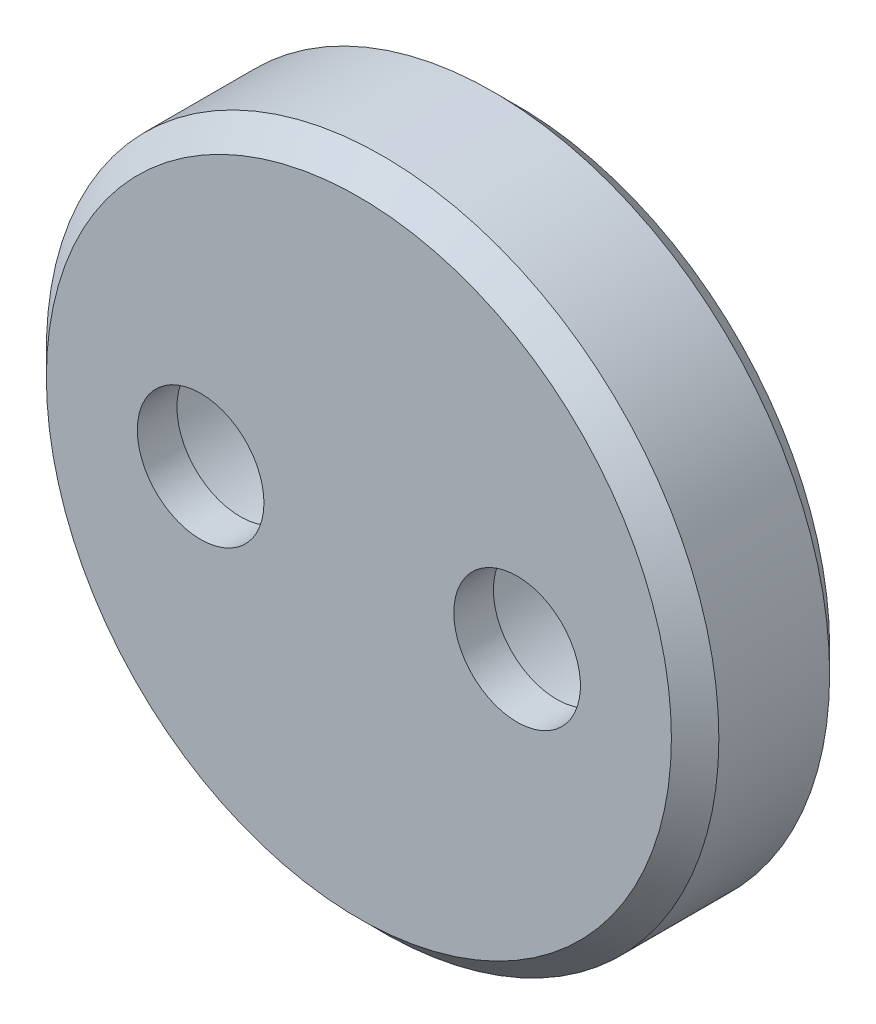
ISO-10303-21;
HEADER;
FILE_DESCRIPTION(('STEP AP214'),'2;1');
FILE_NAME('part.step','',(''),(''),'','','');
FILE_SCHEMA(('AUTOMOTIVE_DESIGN { 1 0 10303 214 1 1 1 1 }'));
ENDSEC;
DATA;
#1=APPLICATION_CONTEXT('core data for automotive mechanical design processes');
#2=APPLICATION_PROTOCOL_DEFINITION('international standard','automotive_design',2000,#1);
#3=PRODUCT_CONTEXT('',#1,'mechanical');
#4=PRODUCT('Part','Part','',(#3));
#5=PRODUCT_RELATED_PRODUCT_CATEGORY('part','',(#4));
#6=PRODUCT_DEFINITION_FORMATION('','',#4);
#7=PRODUCT_DEFINITION_CONTEXT('part definition',#1,'design');
#8=PRODUCT_DEFINITION('design','',#6,#7);
#9=PRODUCT_DEFINITION_SHAPE('','',#8);
#10=(LENGTH_UNIT() NAMED_UNIT(*) SI_UNIT(.MILLI.,.METRE.));
#11=(NAMED_UNIT(*) PLANE_ANGLE_UNIT() SI_UNIT($,.RADIAN.));
#12=(NAMED_UNIT(*) SI_UNIT($,.STERADIAN.) SOLID_ANGLE_UNIT());
#13=UNCERTAINTY_MEASURE_WITH_UNIT(LENGTH_MEASURE(1.E-05),#10,'distance_accuracy_value','');
#14=(GEOMETRIC_REPRESENTATION_CONTEXT(3) GLOBAL_UNCERTAINTY_ASSIGNED_CONTEXT((#13)) GLOBAL_UNIT_ASSIGNED_CONTEXT((#10,
#11,#12)) REPRESENTATION_CONTEXT('',''));
#15=CARTESIAN_POINT('',(0.,0.,0.));
#16=DIRECTION('',(0.,0.,1.));
#17=DIRECTION('',(1.,0.,0.));
#18=AXIS2_PLACEMENT_3D('',#15,#16,#17);
#19=CARTESIAN_POINT('',(4.,0.,4.));
#20=DIRECTION('',(0.,0.,-1.));
#21=DIRECTION('',(-1.,0.,0.));
#22=AXIS2_PLACEMENT_3D('',#19,#20,#21);
#23=CYLINDRICAL_SURFACE('',#22,1.6);
#24=CARTESIAN_POINT('',(4.,0.,4.));
#25=DIRECTION('',(0.,0.,1.));
#26=DIRECTION('',(-1.,0.,0.));
#27=AXIS2_PLACEMENT_3D('',#24,#25,#26);
#28=CIRCLE('',#27,1.6);
#29=CARTESIAN_POINT('',(2.4,0.,4.));
#30=VERTEX_POINT('',#29);
#31=EDGE_CURVE('E60',#30,#30,#28,.T.);
#32=ORIENTED_EDGE('',*,*,#31,.T.);
#33=EDGE_LOOP('',(#32));
#34=FACE_BOUND('',#33,.T.);
#35=CARTESIAN_POINT('',(4.,0.,3.));
#36=DIRECTION('',(0.,0.,-1.));
#37=DIRECTION('',(-1.,0.,0.));
#38=AXIS2_PLACEMENT_3D('',#35,#36,#37);
#39=CIRCLE('',#38,1.6);
#40=CARTESIAN_POINT('',(2.4,0.,3.));
#41=VERTEX_POINT('',#40);
#42=EDGE_CURVE('E52',#41,#41,#39,.T.);
#43=ORIENTED_EDGE('',*,*,#42,.T.);
#44=EDGE_LOOP('',(#43));
#45=FACE_BOUND('',#44,.T.);
#46=ADVANCED_FACE('F31',(#34,#45),#23,.F.);
#47=CARTESIAN_POINT('',(-4.,0.,4.));
#48=DIRECTION('',(0.,0.,-1.));
#49=DIRECTION('',(-1.,0.,0.));
#50=AXIS2_PLACEMENT_3D('',#47,#48,#49);
#51=CYLINDRICAL_SURFACE('',#50,1.6);
#52=CARTESIAN_POINT('',(-4.,0.,4.));
#53=DIRECTION('',(0.,0.,1.));
#54=DIRECTION('',(1.,0.,0.));
#55=AXIS2_PLACEMENT_3D('',#52,#53,#54);
#56=CIRCLE('',#55,1.6);
#57=CARTESIAN_POINT('',(-2.4,0.,4.));
#58=VERTEX_POINT('',#57);
#59=EDGE_CURVE('E51',#58,#58,#56,.T.);
#60=ORIENTED_EDGE('',*,*,#59,.T.);
#61=EDGE_LOOP('',(#60));
#62=FACE_BOUND('',#61,.T.);
#63=CARTESIAN_POINT('',(-4.,0.,3.));
#64=DIRECTION('',(0.,0.,-1.));
#65=DIRECTION('',(-1.,0.,0.));
#66=AXIS2_PLACEMENT_3D('',#63,#64,#65);
#67=CIRCLE('',#66,1.6);
#68=CARTESIAN_POINT('',(-5.6,0.,3.));
#69=VERTEX_POINT('',#68);
#70=EDGE_CURVE('E57',#69,#69,#67,.T.);
#71=ORIENTED_EDGE('',*,*,#70,.T.);
#72=EDGE_LOOP('',(#71));
#73=FACE_BOUND('',#72,.T.);
#74=ADVANCED_FACE('F108',(#62,#73),#51,.F.);
#75=CARTESIAN_POINT('',(0.,0.,4.));
#76=DIRECTION('',(0.,0.,1.));
#77=DIRECTION('',(1.,0.,0.));
#78=AXIS2_PLACEMENT_3D('',#75,#76,#77);
#79=PLANE('',#78);
#80=CARTESIAN_POINT('',(0.,0.,4.));
#81=DIRECTION('',(0.,0.,1.));
#82=DIRECTION('',(1.,0.,0.));
#83=AXIS2_PLACEMENT_3D('',#80,#81,#82);
#84=CIRCLE('',#83,7.9);
#85=CARTESIAN_POINT('',(7.9,0.,4.));
#86=VERTEX_POINT('',#85);
#87=EDGE_CURVE('E46',#86,#86,#84,.T.);
#88=ORIENTED_EDGE('',*,*,#87,.T.);
#89=EDGE_LOOP('',(#88));
#90=FACE_BOUND('',#89,.T.);
#91=ORIENTED_EDGE('',*,*,#59,.F.);
#92=EDGE_LOOP('',(#91));
#93=FACE_BOUND('',#92,.T.);
#94=ORIENTED_EDGE('',*,*,#31,.F.);
#95=EDGE_LOOP('',(#94));
#96=FACE_BOUND('',#95,.T.);
#97=ADVANCED_FACE('F89',(#90,#93,#96),#79,.T.);
#98=CARTESIAN_POINT('',(0.,0.,0.));
#99=DIRECTION('',(0.,0.,1.));
#100=DIRECTION('',(1.,0.,0.));
#101=AXIS2_PLACEMENT_3D('',#98,#99,#100);
#102=PLANE('',#101);
#103=CARTESIAN_POINT('',(0.,0.,0.));
#104=DIRECTION('',(0.,0.,1.));
#105=DIRECTION('',(1.,0.,0.));
#106=AXIS2_PLACEMENT_3D('',#103,#104,#105);
#107=CIRCLE('',#106,7.9);
#108=CARTESIAN_POINT('',(7.9,0.,0.));
#109=VERTEX_POINT('',#108);
#110=EDGE_CURVE('E10',#109,#109,#107,.F.);
#111=ORIENTED_EDGE('',*,*,#110,.T.);
#112=EDGE_LOOP('',(#111));
#113=FACE_BOUND('',#112,.T.);
#114=CARTESIAN_POINT('',(4.,0.,0.));
#115=DIRECTION('',(0.,0.,-1.));
#116=DIRECTION('',(-1.,0.,0.));
#117=AXIS2_PLACEMENT_3D('',#114,#115,#116);
#118=CIRCLE('',#117,2.9);
#119=CARTESIAN_POINT('',(1.1,0.,0.));
#120=VERTEX_POINT('',#119);
#121=EDGE_CURVE('E70',#120,#120,#118,.T.);
#122=ORIENTED_EDGE('',*,*,#121,.F.);
#123=EDGE_LOOP('',(#122));
#124=FACE_BOUND('',#123,.T.);
#125=CARTESIAN_POINT('',(-4.,0.,0.));
#126=DIRECTION('',(0.,0.,-1.));
#127=DIRECTION('',(-1.,0.,0.));
#128=AXIS2_PLACEMENT_3D('',#125,#126,#127);
#129=CIRCLE('',#128,2.9);
#130=CARTESIAN_POINT('',(-6.9,0.,0.));
#131=VERTEX_POINT('',#130);
#132=EDGE_CURVE('E55',#131,#131,#129,.T.);
#133=ORIENTED_EDGE('',*,*,#132,.F.);
#134=EDGE_LOOP('',(#133));
#135=FACE_BOUND('',#134,.T.);
#136=ADVANCED_FACE('F85',(#113,#124,#135),#102,.F.);
#137=CARTESIAN_POINT('',(0.,0.,4.));
#138=DIRECTION('',(0.,0.,-1.));
#139=DIRECTION('',(-1.,0.,0.));
#140=AXIS2_PLACEMENT_3D('',#137,#138,#139);
#141=CYLINDRICAL_SURFACE('',#140,8.5);
#142=CARTESIAN_POINT('',(0.,0.,3.39999999999999));
#143=DIRECTION('',(0.,0.,1.));
#144=DIRECTION('',(1.,0.,0.));
#145=AXIS2_PLACEMENT_3D('',#142,#143,#144);
#146=CIRCLE('',#145,8.5);
#147=CARTESIAN_POINT('',(8.5,0.,3.39999999999999));
#148=VERTEX_POINT('',#147);
#149=EDGE_CURVE('E38',#148,#148,#146,.F.);
#150=ORIENTED_EDGE('',*,*,#149,.T.);
#151=EDGE_LOOP('',(#150));
#152=FACE_BOUND('',#151,.T.);
#153=CARTESIAN_POINT('',(0.,0.,0.600000000000002));
#154=DIRECTION('',(0.,0.,1.));
#155=DIRECTION('',(1.,0.,0.));
#156=AXIS2_PLACEMENT_3D('',#153,#154,#155);
#157=CIRCLE('',#156,8.5);
#158=CARTESIAN_POINT('',(8.5,0.,0.600000000000002));
#159=VERTEX_POINT('',#158);
#160=EDGE_CURVE('E42',#159,#159,#157,.T.);
#161=ORIENTED_EDGE('',*,*,#160,.T.);
#162=EDGE_LOOP('',(#161));
#163=FACE_BOUND('',#162,.T.);
#164=ADVANCED_FACE('F88',(#152,#163),#141,.T.);
#165=CARTESIAN_POINT('',(-4.,0.,3.));
#166=DIRECTION('',(0.,0.,-1.));
#167=DIRECTION('',(-1.,0.,0.));
#168=AXIS2_PLACEMENT_3D('',#165,#166,#167);
#169=CYLINDRICAL_SURFACE('',#168,2.9);
#170=CARTESIAN_POINT('',(-4.,0.,3.));
#171=DIRECTION('',(0.,0.,-1.));
#172=DIRECTION('',(-1.,0.,0.));
#173=AXIS2_PLACEMENT_3D('',#170,#171,#172);
#174=CIRCLE('',#173,2.9);
#175=CARTESIAN_POINT('',(-6.9,0.,3.));
#176=VERTEX_POINT('',#175);
#177=EDGE_CURVE('E61',#176,#176,#174,.T.);
#178=ORIENTED_EDGE('',*,*,#177,.F.);
#179=EDGE_LOOP('',(#178));
#180=FACE_BOUND('',#179,.T.);
#181=ORIENTED_EDGE('',*,*,#132,.T.);
#182=EDGE_LOOP('',(#181));
#183=FACE_BOUND('',#182,.T.);
#184=ADVANCED_FACE('F93',(#180,#183),#169,.F.);
#185=CARTESIAN_POINT('',(-4.,0.,3.));
#186=DIRECTION('',(0.,0.,-1.));
#187=DIRECTION('',(-1.,0.,0.));
#188=AXIS2_PLACEMENT_3D('',#185,#186,#187);
#189=PLANE('',#188);
#190=ORIENTED_EDGE('',*,*,#70,.F.);
#191=EDGE_LOOP('',(#190));
#192=FACE_BOUND('',#191,.T.);
#193=ORIENTED_EDGE('',*,*,#177,.T.);
#194=EDGE_LOOP('',(#193));
#195=FACE_BOUND('',#194,.T.);
#196=ADVANCED_FACE('F81',(#192,#195),#189,.T.);
#197=CARTESIAN_POINT('',(4.,0.,3.));
#198=DIRECTION('',(0.,0.,-1.));
#199=DIRECTION('',(-1.,0.,0.));
#200=AXIS2_PLACEMENT_3D('',#197,#198,#199);
#201=CYLINDRICAL_SURFACE('',#200,2.9);
#202=CARTESIAN_POINT('',(4.,0.,3.));
#203=DIRECTION('',(0.,0.,-1.));
#204=DIRECTION('',(-1.,0.,0.));
#205=AXIS2_PLACEMENT_3D('',#202,#203,#204);
#206=CIRCLE('',#205,2.9);
#207=CARTESIAN_POINT('',(1.1,0.,3.));
#208=VERTEX_POINT('',#207);
#209=EDGE_CURVE('E56',#208,#208,#206,.T.);
#210=ORIENTED_EDGE('',*,*,#209,.F.);
#211=EDGE_LOOP('',(#210));
#212=FACE_BOUND('',#211,.T.);
#213=ORIENTED_EDGE('',*,*,#121,.T.);
#214=EDGE_LOOP('',(#213));
#215=FACE_BOUND('',#214,.T.);
#216=ADVANCED_FACE('F78',(#212,#215),#201,.F.);
#217=CARTESIAN_POINT('',(4.,0.,3.));
#218=DIRECTION('',(0.,0.,-1.));
#219=DIRECTION('',(-1.,0.,0.));
#220=AXIS2_PLACEMENT_3D('',#217,#218,#219);
#221=PLANE('',#220);
#222=ORIENTED_EDGE('',*,*,#42,.F.);
#223=EDGE_LOOP('',(#222));
#224=FACE_BOUND('',#223,.T.);
#225=ORIENTED_EDGE('',*,*,#209,.T.);
#226=EDGE_LOOP('',(#225));
#227=FACE_BOUND('',#226,.T.);
#228=ADVANCED_FACE('F76',(#224,#227),#221,.T.);
#229=CARTESIAN_POINT('',(0.,0.,4.));
#230=DIRECTION('',(0.,0.,-1.));
#231=DIRECTION('',(-1.,0.,0.));
#232=AXIS2_PLACEMENT_3D('',#229,#230,#231);
#233=CONICAL_SURFACE('',#232,7.9,0.785398163397444);
#234=ORIENTED_EDGE('',*,*,#149,.F.);
#235=EDGE_LOOP('',(#234));
#236=FACE_BOUND('',#235,.T.);
#237=ORIENTED_EDGE('',*,*,#87,.F.);
#238=EDGE_LOOP('',(#237));
#239=FACE_BOUND('',#238,.T.);
#240=ADVANCED_FACE('F119',(#236,#239),#233,.T.);
#241=CARTESIAN_POINT('',(0.,0.,0.600000000000002));
#242=DIRECTION('',(0.,0.,1.));
#243=DIRECTION('',(1.,0.,0.));
#244=AXIS2_PLACEMENT_3D('',#241,#242,#243);
#245=CONICAL_SURFACE('',#244,8.5,0.785398163397451);
#246=ORIENTED_EDGE('',*,*,#110,.F.);
#247=EDGE_LOOP('',(#246));
#248=FACE_BOUND('',#247,.T.);
#249=ORIENTED_EDGE('',*,*,#160,.F.);
#250=EDGE_LOOP('',(#249));
#251=FACE_BOUND('',#250,.T.);
#252=ADVANCED_FACE('F33',(#248,#251),#245,.T.);
#253=CLOSED_SHELL('',(#46,#74,#97,#136,#164,#184,#196,#216,#228,#240,#252));
#254=MANIFOLD_SOLID_BREP('B2',#253);
#255=ADVANCED_BREP_SHAPE_REPRESENTATION('',(#18,#254),#14);
#256=SHAPE_DEFINITION_REPRESENTATION(#9,#255);
ENDSEC;
END-ISO-10303-21;
